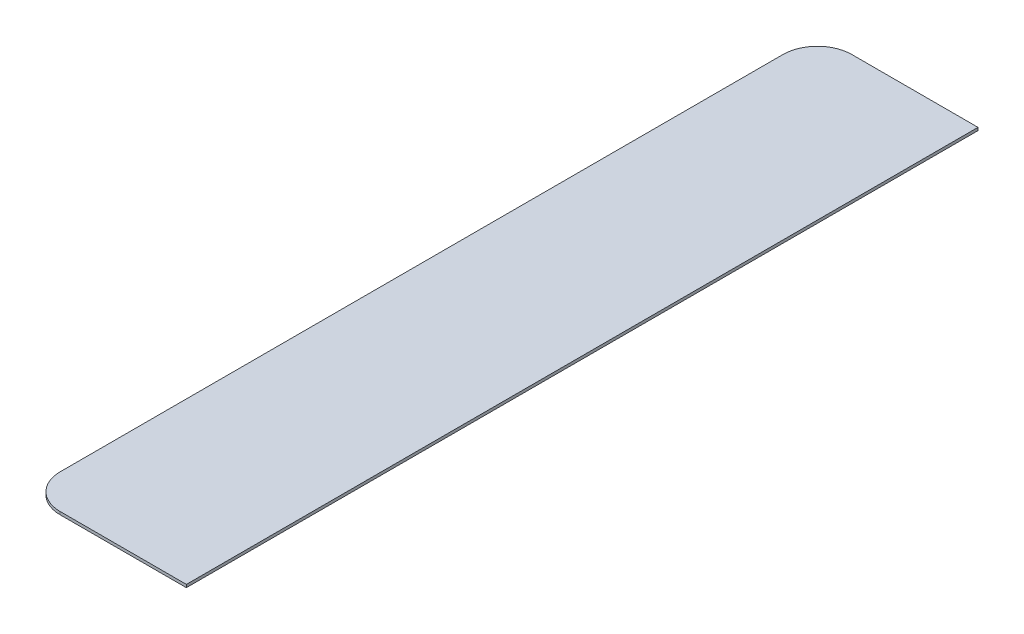
ISO-10303-21;
HEADER;
FILE_DESCRIPTION(('STEP AP214'),'2;1');
FILE_NAME('part.step','',(''),(''),'','','');
FILE_SCHEMA(('AUTOMOTIVE_DESIGN { 1 0 10303 214 1 1 1 1 }'));
ENDSEC;
DATA;
#1=APPLICATION_CONTEXT('core data for automotive mechanical design processes');
#2=APPLICATION_PROTOCOL_DEFINITION('international standard','automotive_design',2000,#1);
#3=PRODUCT_CONTEXT('',#1,'mechanical');
#4=PRODUCT('Part','Part','',(#3));
#5=PRODUCT_RELATED_PRODUCT_CATEGORY('part','',(#4));
#6=PRODUCT_DEFINITION_FORMATION('','',#4);
#7=PRODUCT_DEFINITION_CONTEXT('part definition',#1,'design');
#8=PRODUCT_DEFINITION('design','',#6,#7);
#9=PRODUCT_DEFINITION_SHAPE('','',#8);
#10=(LENGTH_UNIT() NAMED_UNIT(*) SI_UNIT(.MILLI.,.METRE.));
#11=(NAMED_UNIT(*) PLANE_ANGLE_UNIT() SI_UNIT($,.RADIAN.));
#12=(NAMED_UNIT(*) SI_UNIT($,.STERADIAN.) SOLID_ANGLE_UNIT());
#13=UNCERTAINTY_MEASURE_WITH_UNIT(LENGTH_MEASURE(1.E-05),#10,'distance_accuracy_value','');
#14=(GEOMETRIC_REPRESENTATION_CONTEXT(3) GLOBAL_UNCERTAINTY_ASSIGNED_CONTEXT((#13)) GLOBAL_UNIT_ASSIGNED_CONTEXT((#10,
#11,#12)) REPRESENTATION_CONTEXT('',''));
#15=CARTESIAN_POINT('',(0.,0.,0.));
#16=DIRECTION('',(0.,0.,1.));
#17=DIRECTION('',(1.,0.,0.));
#18=AXIS2_PLACEMENT_3D('',#15,#16,#17);
#19=CARTESIAN_POINT('',(0.,6.35,0.));
#20=DIRECTION('',(-1.,0.,0.));
#21=DIRECTION('',(0.,0.,1.));
#22=AXIS2_PLACEMENT_3D('',#19,#20,#21);
#23=PLANE('',#22);
#24=DIRECTION('',(0.,0.,-1.));
#25=VECTOR('',#24,1.);
#26=CARTESIAN_POINT('',(0.,0.,0.));
#27=LINE('',#26,#25);
#28=CARTESIAN_POINT('',(2.14631598018565E-13,0.,1752.6));
#29=VERTEX_POINT('',#28);
#30=CARTESIAN_POINT('',(0.,0.,0.));
#31=VERTEX_POINT('',#30);
#32=EDGE_CURVE('E117',#29,#31,#27,.T.);
#33=ORIENTED_EDGE('',*,*,#32,.T.);
#34=DIRECTION('',(0.,-1.,0.));
#35=VECTOR('',#34,1.);
#36=CARTESIAN_POINT('',(0.,6.35,0.));
#37=LINE('',#36,#35);
#38=CARTESIAN_POINT('',(0.,6.35,0.));
#39=VERTEX_POINT('',#38);
#40=EDGE_CURVE('E11',#39,#31,#37,.T.);
#41=ORIENTED_EDGE('',*,*,#40,.F.);
#42=DIRECTION('',(0.,0.,-1.));
#43=VECTOR('',#42,1.);
#44=CARTESIAN_POINT('',(0.,6.35,0.));
#45=LINE('',#44,#43);
#46=CARTESIAN_POINT('',(2.14631598018565E-13,6.35,1752.6));
#47=VERTEX_POINT('',#46);
#48=EDGE_CURVE('E127',#47,#39,#45,.T.);
#49=ORIENTED_EDGE('',*,*,#48,.F.);
#50=DIRECTION('',(0.,-1.,0.));
#51=VECTOR('',#50,1.);
#52=CARTESIAN_POINT('',(2.14631598018565E-13,6.35,1752.6));
#53=LINE('',#52,#51);
#54=EDGE_CURVE('E113',#47,#29,#53,.T.);
#55=ORIENTED_EDGE('',*,*,#54,.T.);
#56=EDGE_LOOP('',(#33,#41,#49,#55));
#57=FACE_BOUND('',#56,.T.);
#58=ADVANCED_FACE('F33',(#57),#23,.F.);
#59=CARTESIAN_POINT('',(0.,6.35,0.));
#60=DIRECTION('',(0.,0.,1.));
#61=DIRECTION('',(1.,0.,0.));
#62=AXIS2_PLACEMENT_3D('',#59,#60,#61);
#63=PLANE('',#62);
#64=DIRECTION('',(-1.,0.,0.));
#65=VECTOR('',#64,1.);
#66=CARTESIAN_POINT('',(0.,0.,0.));
#67=LINE('',#66,#65);
#68=CARTESIAN_POINT('',(-279.399999999999,0.,0.));
#69=VERTEX_POINT('',#68);
#70=EDGE_CURVE('E120',#31,#69,#67,.T.);
#71=ORIENTED_EDGE('',*,*,#70,.T.);
#72=DIRECTION('',(0.,-1.,0.));
#73=VECTOR('',#72,1.);
#74=CARTESIAN_POINT('',(-279.399999999999,6.35,0.));
#75=LINE('',#74,#73);
#76=CARTESIAN_POINT('',(-279.399999999999,6.35,0.));
#77=VERTEX_POINT('',#76);
#78=EDGE_CURVE('E41',#77,#69,#75,.T.);
#79=ORIENTED_EDGE('',*,*,#78,.F.);
#80=DIRECTION('',(-1.,0.,0.));
#81=VECTOR('',#80,1.);
#82=CARTESIAN_POINT('',(0.,6.35,0.));
#83=LINE('',#82,#81);
#84=EDGE_CURVE('E86',#39,#77,#83,.T.);
#85=ORIENTED_EDGE('',*,*,#84,.F.);
#86=ORIENTED_EDGE('',*,*,#40,.T.);
#87=EDGE_LOOP('',(#71,#79,#85,#86));
#88=FACE_BOUND('',#87,.T.);
#89=ADVANCED_FACE('F151',(#88),#63,.F.);
#90=CARTESIAN_POINT('',(-279.4,6.35,76.2));
#91=DIRECTION('',(0.,-1.,0.));
#92=DIRECTION('',(0.,0.,-1.));
#93=AXIS2_PLACEMENT_3D('',#90,#91,#92);
#94=CYLINDRICAL_SURFACE('',#93,76.2);
#95=CARTESIAN_POINT('',(-279.4,0.,76.2));
#96=DIRECTION('',(0.,1.,0.));
#97=DIRECTION('',(0.,0.,-1.));
#98=AXIS2_PLACEMENT_3D('',#95,#96,#97);
#99=CIRCLE('',#98,76.2);
#100=CARTESIAN_POINT('',(-355.6,0.,76.2000000000006));
#101=VERTEX_POINT('',#100);
#102=EDGE_CURVE('E122',#69,#101,#99,.T.);
#103=ORIENTED_EDGE('',*,*,#102,.T.);
#104=DIRECTION('',(0.,-1.,0.));
#105=VECTOR('',#104,1.);
#106=CARTESIAN_POINT('',(-355.6,6.35,76.2000000000006));
#107=LINE('',#106,#105);
#108=CARTESIAN_POINT('',(-355.6,6.35,76.2000000000006));
#109=VERTEX_POINT('',#108);
#110=EDGE_CURVE('E108',#109,#101,#107,.T.);
#111=ORIENTED_EDGE('',*,*,#110,.F.);
#112=CARTESIAN_POINT('',(-279.4,6.35,76.2));
#113=DIRECTION('',(0.,1.,0.));
#114=DIRECTION('',(0.,0.,-1.));
#115=AXIS2_PLACEMENT_3D('',#112,#113,#114);
#116=CIRCLE('',#115,76.2);
#117=EDGE_CURVE('E99',#77,#109,#116,.T.);
#118=ORIENTED_EDGE('',*,*,#117,.F.);
#119=ORIENTED_EDGE('',*,*,#78,.T.);
#120=EDGE_LOOP('',(#103,#111,#118,#119));
#121=FACE_BOUND('',#120,.T.);
#122=ADVANCED_FACE('F133',(#121),#94,.T.);
#123=CARTESIAN_POINT('',(-355.6,6.35,76.2000000000006));
#124=DIRECTION('',(1.,0.,0.));
#125=DIRECTION('',(0.,0.,-1.));
#126=AXIS2_PLACEMENT_3D('',#123,#124,#125);
#127=PLANE('',#126);
#128=DIRECTION('',(0.,0.,1.));
#129=VECTOR('',#128,1.);
#130=CARTESIAN_POINT('',(-355.6,0.,76.2000000000006));
#131=LINE('',#130,#129);
#132=CARTESIAN_POINT('',(-355.6,0.,1676.4));
#133=VERTEX_POINT('',#132);
#134=EDGE_CURVE('E107',#101,#133,#131,.T.);
#135=ORIENTED_EDGE('',*,*,#134,.T.);
#136=DIRECTION('',(0.,-1.,0.));
#137=VECTOR('',#136,1.);
#138=CARTESIAN_POINT('',(-355.6,6.35,1676.4));
#139=LINE('',#138,#137);
#140=CARTESIAN_POINT('',(-355.6,6.35,1676.4));
#141=VERTEX_POINT('',#140);
#142=EDGE_CURVE('E104',#141,#133,#139,.T.);
#143=ORIENTED_EDGE('',*,*,#142,.F.);
#144=DIRECTION('',(0.,0.,1.));
#145=VECTOR('',#144,1.);
#146=CARTESIAN_POINT('',(-355.6,6.35,76.2000000000006));
#147=LINE('',#146,#145);
#148=EDGE_CURVE('E93',#109,#141,#147,.T.);
#149=ORIENTED_EDGE('',*,*,#148,.F.);
#150=ORIENTED_EDGE('',*,*,#110,.T.);
#151=EDGE_LOOP('',(#135,#143,#149,#150));
#152=FACE_BOUND('',#151,.T.);
#153=ADVANCED_FACE('F105',(#152),#127,.F.);
#154=CARTESIAN_POINT('',(-279.4,6.35,1676.4));
#155=DIRECTION('',(0.,-1.,0.));
#156=DIRECTION('',(0.,0.,-1.));
#157=AXIS2_PLACEMENT_3D('',#154,#155,#156);
#158=CYLINDRICAL_SURFACE('',#157,76.2);
#159=CARTESIAN_POINT('',(-279.4,0.,1676.4));
#160=DIRECTION('',(0.,1.,0.));
#161=DIRECTION('',(0.,0.,1.));
#162=AXIS2_PLACEMENT_3D('',#159,#160,#161);
#163=CIRCLE('',#162,76.2);
#164=CARTESIAN_POINT('',(-279.4,0.,1752.6));
#165=VERTEX_POINT('',#164);
#166=EDGE_CURVE('E72',#133,#165,#163,.T.);
#167=ORIENTED_EDGE('',*,*,#166,.T.);
#168=DIRECTION('',(0.,-1.,0.));
#169=VECTOR('',#168,1.);
#170=CARTESIAN_POINT('',(-279.4,6.35,1752.6));
#171=LINE('',#170,#169);
#172=CARTESIAN_POINT('',(-279.4,6.35,1752.6));
#173=VERTEX_POINT('',#172);
#174=EDGE_CURVE('E109',#173,#165,#171,.T.);
#175=ORIENTED_EDGE('',*,*,#174,.F.);
#176=CARTESIAN_POINT('',(-279.4,6.35,1676.4));
#177=DIRECTION('',(0.,1.,0.));
#178=DIRECTION('',(0.,0.,1.));
#179=AXIS2_PLACEMENT_3D('',#176,#177,#178);
#180=CIRCLE('',#179,76.2);
#181=EDGE_CURVE('E97',#141,#173,#180,.T.);
#182=ORIENTED_EDGE('',*,*,#181,.F.);
#183=ORIENTED_EDGE('',*,*,#142,.T.);
#184=EDGE_LOOP('',(#167,#175,#182,#183));
#185=FACE_BOUND('',#184,.T.);
#186=ADVANCED_FACE('F111',(#185),#158,.T.);
#187=CARTESIAN_POINT('',(2.14631598018565E-13,6.35,1752.6));
#188=DIRECTION('',(0.,0.,-1.));
#189=DIRECTION('',(-1.,0.,0.));
#190=AXIS2_PLACEMENT_3D('',#187,#188,#189);
#191=PLANE('',#190);
#192=DIRECTION('',(1.,0.,0.));
#193=VECTOR('',#192,1.);
#194=CARTESIAN_POINT('',(2.14631598018565E-13,0.,1752.6));
#195=LINE('',#194,#193);
#196=EDGE_CURVE('E78',#165,#29,#195,.T.);
#197=ORIENTED_EDGE('',*,*,#196,.T.);
#198=ORIENTED_EDGE('',*,*,#54,.F.);
#199=DIRECTION('',(1.,0.,0.));
#200=VECTOR('',#199,1.);
#201=CARTESIAN_POINT('',(2.14631598018565E-13,6.35,1752.6));
#202=LINE('',#201,#200);
#203=EDGE_CURVE('E49',#173,#47,#202,.T.);
#204=ORIENTED_EDGE('',*,*,#203,.F.);
#205=ORIENTED_EDGE('',*,*,#174,.T.);
#206=EDGE_LOOP('',(#197,#198,#204,#205));
#207=FACE_BOUND('',#206,.T.);
#208=ADVANCED_FACE('F140',(#207),#191,.F.);
#209=CARTESIAN_POINT('',(-279.4,6.35,1676.4));
#210=DIRECTION('',(0.,1.,0.));
#211=DIRECTION('',(0.,0.,1.));
#212=AXIS2_PLACEMENT_3D('',#209,#210,#211);
#213=PLANE('',#212);
#214=ORIENTED_EDGE('',*,*,#48,.T.);
#215=ORIENTED_EDGE('',*,*,#84,.T.);
#216=ORIENTED_EDGE('',*,*,#117,.T.);
#217=ORIENTED_EDGE('',*,*,#148,.T.);
#218=ORIENTED_EDGE('',*,*,#181,.T.);
#219=ORIENTED_EDGE('',*,*,#203,.T.);
#220=EDGE_LOOP('',(#214,#215,#216,#217,#218,#219));
#221=FACE_BOUND('',#220,.T.);
#222=ADVANCED_FACE('F95',(#221),#213,.T.);
#223=CARTESIAN_POINT('',(-279.4,0.,1676.4));
#224=DIRECTION('',(0.,1.,0.));
#225=DIRECTION('',(0.,0.,1.));
#226=AXIS2_PLACEMENT_3D('',#223,#224,#225);
#227=PLANE('',#226);
#228=ORIENTED_EDGE('',*,*,#32,.F.);
#229=ORIENTED_EDGE('',*,*,#196,.F.);
#230=ORIENTED_EDGE('',*,*,#166,.F.);
#231=ORIENTED_EDGE('',*,*,#134,.F.);
#232=ORIENTED_EDGE('',*,*,#102,.F.);
#233=ORIENTED_EDGE('',*,*,#70,.F.);
#234=EDGE_LOOP('',(#228,#229,#230,#231,#232,#233));
#235=FACE_BOUND('',#234,.T.);
#236=ADVANCED_FACE('F136',(#235),#227,.F.);
#237=CLOSED_SHELL('',(#58,#89,#122,#153,#186,#208,#222,#236));
#238=MANIFOLD_SOLID_BREP('B2',#237);
#239=ADVANCED_BREP_SHAPE_REPRESENTATION('',(#18,#238),#14);
#240=SHAPE_DEFINITION_REPRESENTATION(#9,#239);
ENDSEC;
END-ISO-10303-21;
